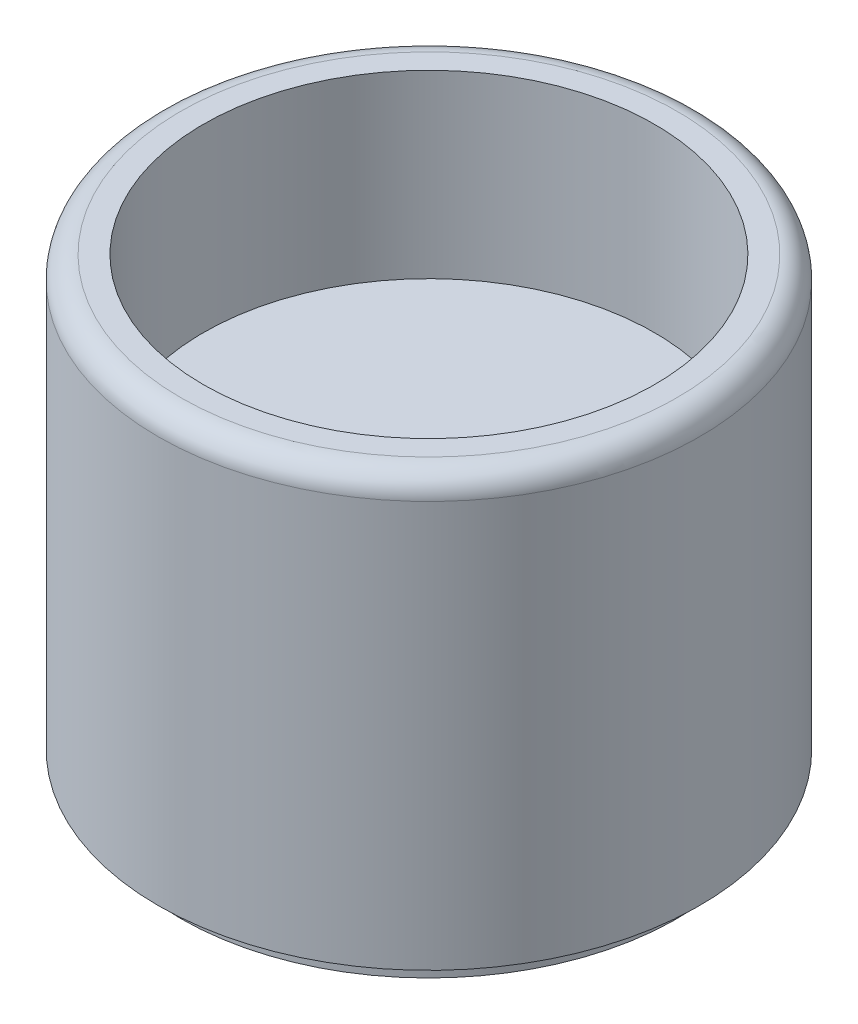
ISO-10303-21;
HEADER;
FILE_DESCRIPTION(('STEP AP214'),'2;1');
FILE_NAME('part.step','',(''),(''),'','','');
FILE_SCHEMA(('AUTOMOTIVE_DESIGN { 1 0 10303 214 1 1 1 1 }'));
ENDSEC;
DATA;
#1=APPLICATION_CONTEXT('core data for automotive mechanical design processes');
#2=APPLICATION_PROTOCOL_DEFINITION('international standard','automotive_design',2000,#1);
#3=PRODUCT_CONTEXT('',#1,'mechanical');
#4=PRODUCT('Part','Part','',(#3));
#5=PRODUCT_RELATED_PRODUCT_CATEGORY('part','',(#4));
#6=PRODUCT_DEFINITION_FORMATION('','',#4);
#7=PRODUCT_DEFINITION_CONTEXT('part definition',#1,'design');
#8=PRODUCT_DEFINITION('design','',#6,#7);
#9=PRODUCT_DEFINITION_SHAPE('','',#8);
#10=(LENGTH_UNIT() NAMED_UNIT(*) SI_UNIT(.MILLI.,.METRE.));
#11=(NAMED_UNIT(*) PLANE_ANGLE_UNIT() SI_UNIT($,.RADIAN.));
#12=(NAMED_UNIT(*) SI_UNIT($,.STERADIAN.) SOLID_ANGLE_UNIT());
#13=UNCERTAINTY_MEASURE_WITH_UNIT(LENGTH_MEASURE(1.E-05),#10,'distance_accuracy_value','');
#14=(GEOMETRIC_REPRESENTATION_CONTEXT(3) GLOBAL_UNCERTAINTY_ASSIGNED_CONTEXT((#13)) GLOBAL_UNIT_ASSIGNED_CONTEXT((#10,
#11,#12)) REPRESENTATION_CONTEXT('',''));
#15=CARTESIAN_POINT('',(0.,0.,0.));
#16=DIRECTION('',(0.,0.,1.));
#17=DIRECTION('',(1.,0.,0.));
#18=AXIS2_PLACEMENT_3D('',#15,#16,#17);
#19=CARTESIAN_POINT('',(0.,10.,0.));
#20=DIRECTION('',(0.,-1.,0.));
#21=DIRECTION('',(0.,0.,-1.));
#22=AXIS2_PLACEMENT_3D('',#19,#20,#21);
#23=CYLINDRICAL_SURFACE('',#22,6.);
#24=CARTESIAN_POINT('',(0.,0.5,0.));
#25=DIRECTION('',(0.,1.,0.));
#26=DIRECTION('',(0.,0.,1.));
#27=AXIS2_PLACEMENT_3D('',#24,#25,#26);
#28=CIRCLE('',#27,6.);
#29=CARTESIAN_POINT('',(0.,0.5,6.));
#30=VERTEX_POINT('',#29);
#31=EDGE_CURVE('E37',#30,#30,#28,.T.);
#32=ORIENTED_EDGE('',*,*,#31,.T.);
#33=EDGE_LOOP('',(#32));
#34=FACE_BOUND('',#33,.T.);
#35=CARTESIAN_POINT('',(0.,9.5,0.));
#36=DIRECTION('',(0.,1.,0.));
#37=DIRECTION('',(0.,0.,1.));
#38=AXIS2_PLACEMENT_3D('',#35,#36,#37);
#39=CIRCLE('',#38,6.);
#40=CARTESIAN_POINT('',(0.,9.5,6.));
#41=VERTEX_POINT('',#40);
#42=EDGE_CURVE('E11',#41,#41,#39,.F.);
#43=ORIENTED_EDGE('',*,*,#42,.T.);
#44=EDGE_LOOP('',(#43));
#45=FACE_BOUND('',#44,.T.);
#46=ADVANCED_FACE('F33',(#34,#45),#23,.T.);
#47=CARTESIAN_POINT('',(0.,10.,0.));
#48=DIRECTION('',(0.,1.,0.));
#49=DIRECTION('',(0.,0.,1.));
#50=AXIS2_PLACEMENT_3D('',#47,#48,#49);
#51=PLANE('',#50);
#52=CARTESIAN_POINT('',(0.,10.,0.));
#53=DIRECTION('',(0.,1.,0.));
#54=DIRECTION('',(0.,0.,1.));
#55=AXIS2_PLACEMENT_3D('',#52,#53,#54);
#56=CIRCLE('',#55,5.);
#57=CARTESIAN_POINT('',(0.,10.,5.));
#58=VERTEX_POINT('',#57);
#59=EDGE_CURVE('E54',#58,#58,#56,.T.);
#60=ORIENTED_EDGE('',*,*,#59,.F.);
#61=EDGE_LOOP('',(#60));
#62=FACE_BOUND('',#61,.T.);
#63=CARTESIAN_POINT('',(0.,10.,0.));
#64=DIRECTION('',(0.,1.,0.));
#65=DIRECTION('',(0.,0.,1.));
#66=AXIS2_PLACEMENT_3D('',#63,#64,#65);
#67=CIRCLE('',#66,5.5);
#68=CARTESIAN_POINT('',(0.,10.,5.5));
#69=VERTEX_POINT('',#68);
#70=EDGE_CURVE('E41',#69,#69,#67,.T.);
#71=ORIENTED_EDGE('',*,*,#70,.T.);
#72=EDGE_LOOP('',(#71));
#73=FACE_BOUND('',#72,.T.);
#74=ADVANCED_FACE('F69',(#62,#73),#51,.T.);
#75=CARTESIAN_POINT('',(0.,9.5,0.));
#76=DIRECTION('',(0.,1.,0.));
#77=DIRECTION('',(0.,0.,1.));
#78=AXIS2_PLACEMENT_3D('',#75,#76,#77);
#79=TOROIDAL_SURFACE('',#78,5.5,0.5);
#80=ORIENTED_EDGE('',*,*,#42,.F.);
#81=EDGE_LOOP('',(#80));
#82=FACE_BOUND('',#81,.T.);
#83=ORIENTED_EDGE('',*,*,#70,.F.);
#84=EDGE_LOOP('',(#83));
#85=FACE_BOUND('',#84,.T.);
#86=ADVANCED_FACE('F35',(#82,#85),#79,.T.);
#87=CARTESIAN_POINT('',(0.,0.5,0.));
#88=DIRECTION('',(0.,1.,0.));
#89=DIRECTION('',(0.,0.,1.));
#90=AXIS2_PLACEMENT_3D('',#87,#88,#89);
#91=PLANE('',#90);
#92=CARTESIAN_POINT('',(0.,0.5,0.));
#93=DIRECTION('',(0.,1.,0.));
#94=DIRECTION('',(0.,0.,1.));
#95=AXIS2_PLACEMENT_3D('',#92,#93,#94);
#96=CIRCLE('',#95,5.5);
#97=CARTESIAN_POINT('',(0.,0.5,5.5));
#98=VERTEX_POINT('',#97);
#99=EDGE_CURVE('E50',#98,#98,#96,.T.);
#100=ORIENTED_EDGE('',*,*,#99,.T.);
#101=EDGE_LOOP('',(#100));
#102=FACE_BOUND('',#101,.T.);
#103=ORIENTED_EDGE('',*,*,#31,.F.);
#104=EDGE_LOOP('',(#103));
#105=FACE_BOUND('',#104,.T.);
#106=ADVANCED_FACE('F76',(#102,#105),#91,.F.);
#107=CARTESIAN_POINT('',(0.,0.5,0.));
#108=DIRECTION('',(0.,-1.,0.));
#109=DIRECTION('',(0.,0.,-1.));
#110=AXIS2_PLACEMENT_3D('',#107,#108,#109);
#111=CYLINDRICAL_SURFACE('',#110,5.5);
#112=ORIENTED_EDGE('',*,*,#99,.F.);
#113=EDGE_LOOP('',(#112));
#114=FACE_BOUND('',#113,.T.);
#115=CARTESIAN_POINT('',(0.,0.,0.));
#116=DIRECTION('',(0.,1.,0.));
#117=DIRECTION('',(0.,0.,1.));
#118=AXIS2_PLACEMENT_3D('',#115,#116,#117);
#119=CIRCLE('',#118,5.5);
#120=CARTESIAN_POINT('',(0.,0.,5.5));
#121=VERTEX_POINT('',#120);
#122=EDGE_CURVE('E47',#121,#121,#119,.T.);
#123=ORIENTED_EDGE('',*,*,#122,.T.);
#124=EDGE_LOOP('',(#123));
#125=FACE_BOUND('',#124,.T.);
#126=ADVANCED_FACE('F81',(#114,#125),#111,.T.);
#127=CARTESIAN_POINT('',(0.,0.,0.));
#128=DIRECTION('',(0.,1.,0.));
#129=DIRECTION('',(0.,0.,1.));
#130=AXIS2_PLACEMENT_3D('',#127,#128,#129);
#131=PLANE('',#130);
#132=ORIENTED_EDGE('',*,*,#122,.F.);
#133=EDGE_LOOP('',(#132));
#134=FACE_BOUND('',#133,.T.);
#135=ADVANCED_FACE('F65',(#134),#131,.F.);
#136=CARTESIAN_POINT('',(0.,6.,0.));
#137=DIRECTION('',(0.,1.,0.));
#138=DIRECTION('',(0.,0.,1.));
#139=AXIS2_PLACEMENT_3D('',#136,#137,#138);
#140=CYLINDRICAL_SURFACE('',#139,5.);
#141=CARTESIAN_POINT('',(0.,6.,0.));
#142=DIRECTION('',(0.,1.,0.));
#143=DIRECTION('',(0.,0.,1.));
#144=AXIS2_PLACEMENT_3D('',#141,#142,#143);
#145=CIRCLE('',#144,5.);
#146=CARTESIAN_POINT('',(0.,6.,5.));
#147=VERTEX_POINT('',#146);
#148=EDGE_CURVE('E51',#147,#147,#145,.T.);
#149=ORIENTED_EDGE('',*,*,#148,.F.);
#150=EDGE_LOOP('',(#149));
#151=FACE_BOUND('',#150,.T.);
#152=ORIENTED_EDGE('',*,*,#59,.T.);
#153=EDGE_LOOP('',(#152));
#154=FACE_BOUND('',#153,.T.);
#155=ADVANCED_FACE('F62',(#151,#154),#140,.F.);
#156=CARTESIAN_POINT('',(0.,6.,0.));
#157=DIRECTION('',(0.,1.,0.));
#158=DIRECTION('',(0.,0.,1.));
#159=AXIS2_PLACEMENT_3D('',#156,#157,#158);
#160=PLANE('',#159);
#161=ORIENTED_EDGE('',*,*,#148,.T.);
#162=EDGE_LOOP('',(#161));
#163=FACE_BOUND('',#162,.T.);
#164=ADVANCED_FACE('F60',(#163),#160,.T.);
#165=CLOSED_SHELL('',(#46,#74,#86,#106,#126,#135,#155,#164));
#166=MANIFOLD_SOLID_BREP('B2',#165);
#167=ADVANCED_BREP_SHAPE_REPRESENTATION('',(#18,#166),#14);
#168=SHAPE_DEFINITION_REPRESENTATION(#9,#167);
ENDSEC;
END-ISO-10303-21;
